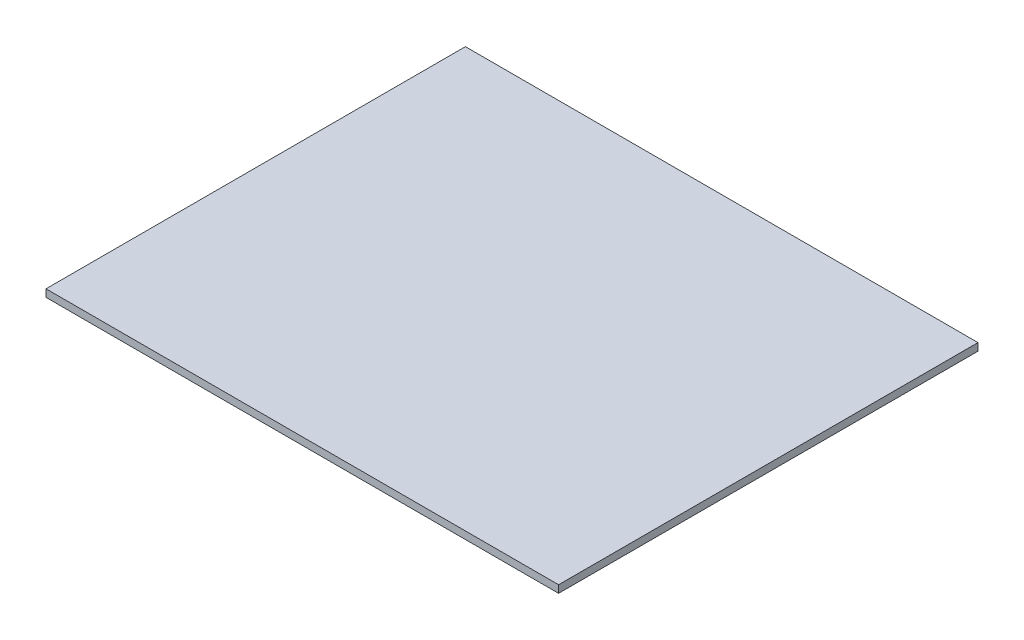
ISO-10303-21;
HEADER;
FILE_DESCRIPTION(('STEP AP214'),'2;1');
FILE_NAME('part.step','',(''),(''),'','','');
FILE_SCHEMA(('AUTOMOTIVE_DESIGN { 1 0 10303 214 1 1 1 1 }'));
ENDSEC;
DATA;
#1=APPLICATION_CONTEXT('core data for automotive mechanical design processes');
#2=APPLICATION_PROTOCOL_DEFINITION('international standard','automotive_design',2000,#1);
#3=PRODUCT_CONTEXT('',#1,'mechanical');
#4=PRODUCT('Part','Part','',(#3));
#5=PRODUCT_RELATED_PRODUCT_CATEGORY('part','',(#4));
#6=PRODUCT_DEFINITION_FORMATION('','',#4);
#7=PRODUCT_DEFINITION_CONTEXT('part definition',#1,'design');
#8=PRODUCT_DEFINITION('design','',#6,#7);
#9=PRODUCT_DEFINITION_SHAPE('','',#8);
#10=(LENGTH_UNIT() NAMED_UNIT(*) SI_UNIT(.MILLI.,.METRE.));
#11=(NAMED_UNIT(*) PLANE_ANGLE_UNIT() SI_UNIT($,.RADIAN.));
#12=(NAMED_UNIT(*) SI_UNIT($,.STERADIAN.) SOLID_ANGLE_UNIT());
#13=UNCERTAINTY_MEASURE_WITH_UNIT(LENGTH_MEASURE(1.E-05),#10,'distance_accuracy_value','');
#14=(GEOMETRIC_REPRESENTATION_CONTEXT(3) GLOBAL_UNCERTAINTY_ASSIGNED_CONTEXT((#13)) GLOBAL_UNIT_ASSIGNED_CONTEXT((#10,
#11,#12)) REPRESENTATION_CONTEXT('',''));
#15=CARTESIAN_POINT('',(0.,0.,0.));
#16=DIRECTION('',(0.,0.,1.));
#17=DIRECTION('',(1.,0.,0.));
#18=AXIS2_PLACEMENT_3D('',#15,#16,#17);
#19=CARTESIAN_POINT('',(0.,1.6,0.));
#20=DIRECTION('',(1.,0.,0.));
#21=DIRECTION('',(0.,0.,-1.));
#22=AXIS2_PLACEMENT_3D('',#19,#20,#21);
#23=PLANE('',#22);
#24=DIRECTION('',(0.,0.,1.));
#25=VECTOR('',#24,1.);
#26=CARTESIAN_POINT('',(0.,0.,0.));
#27=LINE('',#26,#25);
#28=CARTESIAN_POINT('',(0.,0.,-90.));
#29=VERTEX_POINT('',#28);
#30=CARTESIAN_POINT('',(0.,0.,0.));
#31=VERTEX_POINT('',#30);
#32=EDGE_CURVE('E98',#29,#31,#27,.T.);
#33=ORIENTED_EDGE('',*,*,#32,.T.);
#34=DIRECTION('',(0.,-1.,0.));
#35=VECTOR('',#34,1.);
#36=CARTESIAN_POINT('',(0.,1.6,0.));
#37=LINE('',#36,#35);
#38=CARTESIAN_POINT('',(0.,1.6,0.));
#39=VERTEX_POINT('',#38);
#40=EDGE_CURVE('E11',#39,#31,#37,.T.);
#41=ORIENTED_EDGE('',*,*,#40,.F.);
#42=DIRECTION('',(0.,0.,1.));
#43=VECTOR('',#42,1.);
#44=CARTESIAN_POINT('',(0.,1.6,0.));
#45=LINE('',#44,#43);
#46=CARTESIAN_POINT('',(0.,1.6,-90.));
#47=VERTEX_POINT('',#46);
#48=EDGE_CURVE('E86',#47,#39,#45,.T.);
#49=ORIENTED_EDGE('',*,*,#48,.F.);
#50=DIRECTION('',(0.,-1.,0.));
#51=VECTOR('',#50,1.);
#52=CARTESIAN_POINT('',(0.,1.6,-90.));
#53=LINE('',#52,#51);
#54=EDGE_CURVE('E94',#47,#29,#53,.T.);
#55=ORIENTED_EDGE('',*,*,#54,.T.);
#56=EDGE_LOOP('',(#33,#41,#49,#55));
#57=FACE_BOUND('',#56,.T.);
#58=ADVANCED_FACE('F35',(#57),#23,.F.);
#59=CARTESIAN_POINT('',(0.,1.6,0.));
#60=DIRECTION('',(0.,0.,-1.));
#61=DIRECTION('',(-1.,0.,0.));
#62=AXIS2_PLACEMENT_3D('',#59,#60,#61);
#63=PLANE('',#62);
#64=DIRECTION('',(1.,0.,0.));
#65=VECTOR('',#64,1.);
#66=CARTESIAN_POINT('',(0.,0.,0.));
#67=LINE('',#66,#65);
#68=CARTESIAN_POINT('',(110.,0.,0.));
#69=VERTEX_POINT('',#68);
#70=EDGE_CURVE('E90',#31,#69,#67,.T.);
#71=ORIENTED_EDGE('',*,*,#70,.T.);
#72=DIRECTION('',(0.,-1.,0.));
#73=VECTOR('',#72,1.);
#74=CARTESIAN_POINT('',(110.,1.6,0.));
#75=LINE('',#74,#73);
#76=CARTESIAN_POINT('',(110.,1.6,0.));
#77=VERTEX_POINT('',#76);
#78=EDGE_CURVE('E43',#77,#69,#75,.T.);
#79=ORIENTED_EDGE('',*,*,#78,.F.);
#80=DIRECTION('',(1.,0.,0.));
#81=VECTOR('',#80,1.);
#82=CARTESIAN_POINT('',(0.,1.6,0.));
#83=LINE('',#82,#81);
#84=EDGE_CURVE('E81',#39,#77,#83,.T.);
#85=ORIENTED_EDGE('',*,*,#84,.F.);
#86=ORIENTED_EDGE('',*,*,#40,.T.);
#87=EDGE_LOOP('',(#71,#79,#85,#86));
#88=FACE_BOUND('',#87,.T.);
#89=ADVANCED_FACE('F89',(#88),#63,.F.);
#90=CARTESIAN_POINT('',(110.,1.6,0.));
#91=DIRECTION('',(-1.,0.,0.));
#92=DIRECTION('',(0.,0.,1.));
#93=AXIS2_PLACEMENT_3D('',#90,#91,#92);
#94=PLANE('',#93);
#95=DIRECTION('',(0.,0.,-1.));
#96=VECTOR('',#95,1.);
#97=CARTESIAN_POINT('',(110.,0.,0.));
#98=LINE('',#97,#96);
#99=CARTESIAN_POINT('',(110.,0.,-90.));
#100=VERTEX_POINT('',#99);
#101=EDGE_CURVE('E68',#69,#100,#98,.T.);
#102=ORIENTED_EDGE('',*,*,#101,.T.);
#103=DIRECTION('',(0.,-1.,0.));
#104=VECTOR('',#103,1.);
#105=CARTESIAN_POINT('',(110.,1.6,-90.));
#106=LINE('',#105,#104);
#107=CARTESIAN_POINT('',(110.,1.6,-90.));
#108=VERTEX_POINT('',#107);
#109=EDGE_CURVE('E91',#108,#100,#106,.T.);
#110=ORIENTED_EDGE('',*,*,#109,.F.);
#111=DIRECTION('',(0.,0.,-1.));
#112=VECTOR('',#111,1.);
#113=CARTESIAN_POINT('',(110.,1.6,0.));
#114=LINE('',#113,#112);
#115=EDGE_CURVE('E84',#77,#108,#114,.T.);
#116=ORIENTED_EDGE('',*,*,#115,.F.);
#117=ORIENTED_EDGE('',*,*,#78,.T.);
#118=EDGE_LOOP('',(#102,#110,#116,#117));
#119=FACE_BOUND('',#118,.T.);
#120=ADVANCED_FACE('F92',(#119),#94,.F.);
#121=CARTESIAN_POINT('',(0.,1.6,-90.));
#122=DIRECTION('',(0.,0.,1.));
#123=DIRECTION('',(1.,0.,0.));
#124=AXIS2_PLACEMENT_3D('',#121,#122,#123);
#125=PLANE('',#124);
#126=DIRECTION('',(-1.,0.,0.));
#127=VECTOR('',#126,1.);
#128=CARTESIAN_POINT('',(0.,0.,-90.));
#129=LINE('',#128,#127);
#130=EDGE_CURVE('E74',#100,#29,#129,.T.);
#131=ORIENTED_EDGE('',*,*,#130,.T.);
#132=ORIENTED_EDGE('',*,*,#54,.F.);
#133=DIRECTION('',(-1.,0.,0.));
#134=VECTOR('',#133,1.);
#135=CARTESIAN_POINT('',(0.,1.6,-90.));
#136=LINE('',#135,#134);
#137=EDGE_CURVE('E51',#108,#47,#136,.T.);
#138=ORIENTED_EDGE('',*,*,#137,.F.);
#139=ORIENTED_EDGE('',*,*,#109,.T.);
#140=EDGE_LOOP('',(#131,#132,#138,#139));
#141=FACE_BOUND('',#140,.T.);
#142=ADVANCED_FACE('F105',(#141),#125,.F.);
#143=CARTESIAN_POINT('',(0.,1.6,0.));
#144=DIRECTION('',(0.,-1.,0.));
#145=DIRECTION('',(0.,0.,-1.));
#146=AXIS2_PLACEMENT_3D('',#143,#144,#145);
#147=PLANE('',#146);
#148=ORIENTED_EDGE('',*,*,#48,.T.);
#149=ORIENTED_EDGE('',*,*,#84,.T.);
#150=ORIENTED_EDGE('',*,*,#115,.T.);
#151=ORIENTED_EDGE('',*,*,#137,.T.);
#152=EDGE_LOOP('',(#148,#149,#150,#151));
#153=FACE_BOUND('',#152,.T.);
#154=ADVANCED_FACE('F82',(#153),#147,.F.);
#155=CARTESIAN_POINT('',(0.,0.,0.));
#156=DIRECTION('',(0.,-1.,0.));
#157=DIRECTION('',(0.,0.,-1.));
#158=AXIS2_PLACEMENT_3D('',#155,#156,#157);
#159=PLANE('',#158);
#160=ORIENTED_EDGE('',*,*,#32,.F.);
#161=ORIENTED_EDGE('',*,*,#130,.F.);
#162=ORIENTED_EDGE('',*,*,#101,.F.);
#163=ORIENTED_EDGE('',*,*,#70,.F.);
#164=EDGE_LOOP('',(#160,#161,#162,#163));
#165=FACE_BOUND('',#164,.T.);
#166=ADVANCED_FACE('F108',(#165),#159,.T.);
#167=CLOSED_SHELL('',(#58,#89,#120,#142,#154,#166));
#168=MANIFOLD_SOLID_BREP('B2',#167);
#169=ADVANCED_BREP_SHAPE_REPRESENTATION('',(#18,#168),#14);
#170=SHAPE_DEFINITION_REPRESENTATION(#9,#169);
ENDSEC;
END-ISO-10303-21;
